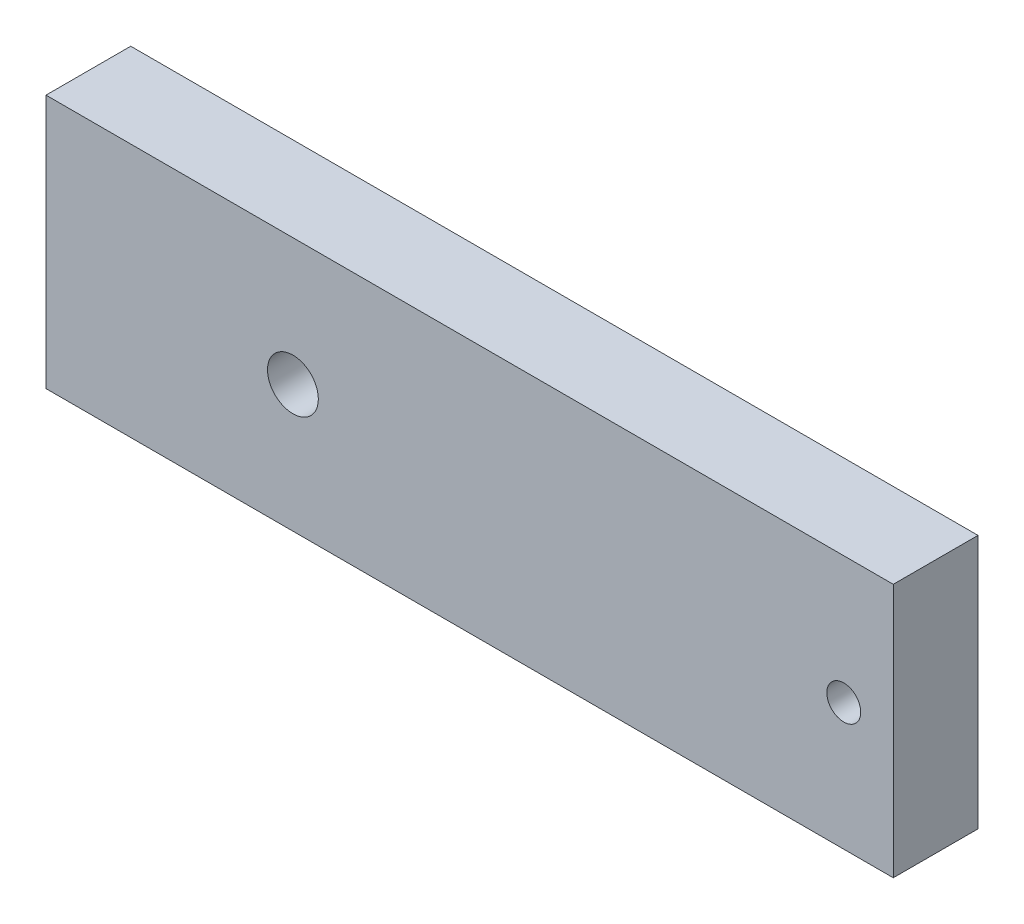
ISO-10303-21;
HEADER;
FILE_DESCRIPTION(('STEP AP214'),'2;1');
FILE_NAME('part.step','',(''),(''),'','','');
FILE_SCHEMA(('AUTOMOTIVE_DESIGN { 1 0 10303 214 1 1 1 1 }'));
ENDSEC;
DATA;
#1=APPLICATION_CONTEXT('core data for automotive mechanical design processes');
#2=APPLICATION_PROTOCOL_DEFINITION('international standard','automotive_design',2000,#1);
#3=PRODUCT_CONTEXT('',#1,'mechanical');
#4=PRODUCT('Part','Part','',(#3));
#5=PRODUCT_RELATED_PRODUCT_CATEGORY('part','',(#4));
#6=PRODUCT_DEFINITION_FORMATION('','',#4);
#7=PRODUCT_DEFINITION_CONTEXT('part definition',#1,'design');
#8=PRODUCT_DEFINITION('design','',#6,#7);
#9=PRODUCT_DEFINITION_SHAPE('','',#8);
#10=(LENGTH_UNIT() NAMED_UNIT(*) SI_UNIT(.MILLI.,.METRE.));
#11=(NAMED_UNIT(*) PLANE_ANGLE_UNIT() SI_UNIT($,.RADIAN.));
#12=(NAMED_UNIT(*) SI_UNIT($,.STERADIAN.) SOLID_ANGLE_UNIT());
#13=UNCERTAINTY_MEASURE_WITH_UNIT(LENGTH_MEASURE(1.E-05),#10,'distance_accuracy_value','');
#14=(GEOMETRIC_REPRESENTATION_CONTEXT(3) GLOBAL_UNCERTAINTY_ASSIGNED_CONTEXT((#13)) GLOBAL_UNIT_ASSIGNED_CONTEXT((#10,
#11,#12)) REPRESENTATION_CONTEXT('',''));
#15=CARTESIAN_POINT('',(0.,0.,0.));
#16=DIRECTION('',(0.,0.,1.));
#17=DIRECTION('',(1.,0.,0.));
#18=AXIS2_PLACEMENT_3D('',#15,#16,#17);
#19=CARTESIAN_POINT('',(25.,-7.5,5.));
#20=DIRECTION('',(-1.,0.,0.));
#21=DIRECTION('',(0.,0.,1.));
#22=AXIS2_PLACEMENT_3D('',#19,#20,#21);
#23=PLANE('',#22);
#24=DIRECTION('',(0.,1.,0.));
#25=VECTOR('',#24,1.);
#26=CARTESIAN_POINT('',(25.,-7.5,0.));
#27=LINE('',#26,#25);
#28=CARTESIAN_POINT('',(25.,-7.5,0.));
#29=VERTEX_POINT('',#28);
#30=CARTESIAN_POINT('',(25.,7.5,0.));
#31=VERTEX_POINT('',#30);
#32=EDGE_CURVE('E96',#29,#31,#27,.T.);
#33=ORIENTED_EDGE('',*,*,#32,.T.);
#34=DIRECTION('',(0.,0.,-1.));
#35=VECTOR('',#34,1.);
#36=CARTESIAN_POINT('',(25.,7.5,5.));
#37=LINE('',#36,#35);
#38=CARTESIAN_POINT('',(25.,7.5,5.));
#39=VERTEX_POINT('',#38);
#40=EDGE_CURVE('E11',#39,#31,#37,.T.);
#41=ORIENTED_EDGE('',*,*,#40,.F.);
#42=DIRECTION('',(0.,1.,0.));
#43=VECTOR('',#42,1.);
#44=CARTESIAN_POINT('',(25.,-7.5,5.));
#45=LINE('',#44,#43);
#46=CARTESIAN_POINT('',(25.,-7.5,5.));
#47=VERTEX_POINT('',#46);
#48=EDGE_CURVE('E84',#47,#39,#45,.T.);
#49=ORIENTED_EDGE('',*,*,#48,.F.);
#50=DIRECTION('',(0.,0.,-1.));
#51=VECTOR('',#50,1.);
#52=CARTESIAN_POINT('',(25.,-7.5,5.));
#53=LINE('',#52,#51);
#54=EDGE_CURVE('E92',#47,#29,#53,.T.);
#55=ORIENTED_EDGE('',*,*,#54,.T.);
#56=EDGE_LOOP('',(#33,#41,#49,#55));
#57=FACE_BOUND('',#56,.T.);
#58=ADVANCED_FACE('F33',(#57),#23,.F.);
#59=CARTESIAN_POINT('',(-25.,7.5,5.));
#60=DIRECTION('',(0.,-1.,0.));
#61=DIRECTION('',(0.,0.,-1.));
#62=AXIS2_PLACEMENT_3D('',#59,#60,#61);
#63=PLANE('',#62);
#64=DIRECTION('',(-1.,0.,0.));
#65=VECTOR('',#64,1.);
#66=CARTESIAN_POINT('',(-25.,7.5,0.));
#67=LINE('',#66,#65);
#68=CARTESIAN_POINT('',(-25.,7.5,0.));
#69=VERTEX_POINT('',#68);
#70=EDGE_CURVE('E88',#31,#69,#67,.T.);
#71=ORIENTED_EDGE('',*,*,#70,.T.);
#72=DIRECTION('',(0.,0.,-1.));
#73=VECTOR('',#72,1.);
#74=CARTESIAN_POINT('',(-25.,7.5,5.));
#75=LINE('',#74,#73);
#76=CARTESIAN_POINT('',(-25.,7.5,5.));
#77=VERTEX_POINT('',#76);
#78=EDGE_CURVE('E41',#77,#69,#75,.T.);
#79=ORIENTED_EDGE('',*,*,#78,.F.);
#80=DIRECTION('',(-1.,0.,0.));
#81=VECTOR('',#80,1.);
#82=CARTESIAN_POINT('',(-25.,7.5,5.));
#83=LINE('',#82,#81);
#84=EDGE_CURVE('E79',#39,#77,#83,.T.);
#85=ORIENTED_EDGE('',*,*,#84,.F.);
#86=ORIENTED_EDGE('',*,*,#40,.T.);
#87=EDGE_LOOP('',(#71,#79,#85,#86));
#88=FACE_BOUND('',#87,.T.);
#89=ADVANCED_FACE('F87',(#88),#63,.F.);
#90=CARTESIAN_POINT('',(-25.,-7.5,5.));
#91=DIRECTION('',(1.,0.,0.));
#92=DIRECTION('',(0.,0.,-1.));
#93=AXIS2_PLACEMENT_3D('',#90,#91,#92);
#94=PLANE('',#93);
#95=DIRECTION('',(0.,-1.,0.));
#96=VECTOR('',#95,1.);
#97=CARTESIAN_POINT('',(-25.,-7.5,0.));
#98=LINE('',#97,#96);
#99=CARTESIAN_POINT('',(-25.,-7.5,0.));
#100=VERTEX_POINT('',#99);
#101=EDGE_CURVE('E66',#69,#100,#98,.T.);
#102=ORIENTED_EDGE('',*,*,#101,.T.);
#103=DIRECTION('',(0.,0.,-1.));
#104=VECTOR('',#103,1.);
#105=CARTESIAN_POINT('',(-25.,-7.5,5.));
#106=LINE('',#105,#104);
#107=CARTESIAN_POINT('',(-25.,-7.5,5.));
#108=VERTEX_POINT('',#107);
#109=EDGE_CURVE('E89',#108,#100,#106,.T.);
#110=ORIENTED_EDGE('',*,*,#109,.F.);
#111=DIRECTION('',(0.,-1.,0.));
#112=VECTOR('',#111,1.);
#113=CARTESIAN_POINT('',(-25.,-7.5,5.));
#114=LINE('',#113,#112);
#115=EDGE_CURVE('E82',#77,#108,#114,.T.);
#116=ORIENTED_EDGE('',*,*,#115,.F.);
#117=ORIENTED_EDGE('',*,*,#78,.T.);
#118=EDGE_LOOP('',(#102,#110,#116,#117));
#119=FACE_BOUND('',#118,.T.);
#120=ADVANCED_FACE('F90',(#119),#94,.F.);
#121=CARTESIAN_POINT('',(-25.,-7.5,5.));
#122=DIRECTION('',(0.,1.,0.));
#123=DIRECTION('',(0.,0.,1.));
#124=AXIS2_PLACEMENT_3D('',#121,#122,#123);
#125=PLANE('',#124);
#126=DIRECTION('',(1.,0.,0.));
#127=VECTOR('',#126,1.);
#128=CARTESIAN_POINT('',(-25.,-7.5,0.));
#129=LINE('',#128,#127);
#130=EDGE_CURVE('E72',#100,#29,#129,.T.);
#131=ORIENTED_EDGE('',*,*,#130,.T.);
#132=ORIENTED_EDGE('',*,*,#54,.F.);
#133=DIRECTION('',(1.,0.,0.));
#134=VECTOR('',#133,1.);
#135=CARTESIAN_POINT('',(-25.,-7.5,5.));
#136=LINE('',#135,#134);
#137=EDGE_CURVE('E49',#108,#47,#136,.T.);
#138=ORIENTED_EDGE('',*,*,#137,.F.);
#139=ORIENTED_EDGE('',*,*,#109,.T.);
#140=EDGE_LOOP('',(#131,#132,#138,#139));
#141=FACE_BOUND('',#140,.T.);
#142=ADVANCED_FACE('F104',(#141),#125,.F.);
#143=CARTESIAN_POINT('',(0.,0.,5.));
#144=DIRECTION('',(0.,0.,-1.));
#145=DIRECTION('',(-1.,0.,0.));
#146=AXIS2_PLACEMENT_3D('',#143,#144,#145);
#147=PLANE('',#146);
#148=CARTESIAN_POINT('',(22.0789346408499,0.,5.));
#149=DIRECTION('',(0.,0.,1.));
#150=DIRECTION('',(1.,0.,0.));
#151=AXIS2_PLACEMENT_3D('',#148,#149,#150);
#152=CIRCLE('',#151,1.);
#153=CARTESIAN_POINT('',(23.0789346408499,0.,5.));
#154=VERTEX_POINT('',#153);
#155=EDGE_CURVE('E116',#154,#154,#152,.T.);
#156=ORIENTED_EDGE('',*,*,#155,.F.);
#157=EDGE_LOOP('',(#156));
#158=FACE_BOUND('',#157,.T.);
#159=CARTESIAN_POINT('',(-10.4291883393694,0.,5.));
#160=DIRECTION('',(0.,0.,1.));
#161=DIRECTION('',(1.,0.,0.));
#162=AXIS2_PLACEMENT_3D('',#159,#160,#161);
#163=CIRCLE('',#162,1.5);
#164=CARTESIAN_POINT('',(-8.92918833936943,0.,5.));
#165=VERTEX_POINT('',#164);
#166=EDGE_CURVE('E110',#165,#165,#163,.T.);
#167=ORIENTED_EDGE('',*,*,#166,.F.);
#168=EDGE_LOOP('',(#167));
#169=FACE_BOUND('',#168,.T.);
#170=ORIENTED_EDGE('',*,*,#48,.T.);
#171=ORIENTED_EDGE('',*,*,#84,.T.);
#172=ORIENTED_EDGE('',*,*,#115,.T.);
#173=ORIENTED_EDGE('',*,*,#137,.T.);
#174=EDGE_LOOP('',(#170,#171,#172,#173));
#175=FACE_BOUND('',#174,.T.);
#176=ADVANCED_FACE('F80',(#158,#169,#175),#147,.F.);
#177=CARTESIAN_POINT('',(0.,0.,0.));
#178=DIRECTION('',(0.,0.,-1.));
#179=DIRECTION('',(-1.,0.,0.));
#180=AXIS2_PLACEMENT_3D('',#177,#178,#179);
#181=PLANE('',#180);
#182=CARTESIAN_POINT('',(22.0789346408499,0.,0.));
#183=DIRECTION('',(0.,0.,1.));
#184=DIRECTION('',(1.,0.,0.));
#185=AXIS2_PLACEMENT_3D('',#182,#183,#184);
#186=CIRCLE('',#185,1.);
#187=CARTESIAN_POINT('',(23.0789346408499,0.,0.));
#188=VERTEX_POINT('',#187);
#189=EDGE_CURVE('E113',#188,#188,#186,.T.);
#190=ORIENTED_EDGE('',*,*,#189,.T.);
#191=EDGE_LOOP('',(#190));
#192=FACE_BOUND('',#191,.T.);
#193=CARTESIAN_POINT('',(-10.4291883393694,0.,0.));
#194=DIRECTION('',(0.,0.,1.));
#195=DIRECTION('',(1.,0.,0.));
#196=AXIS2_PLACEMENT_3D('',#193,#194,#195);
#197=CIRCLE('',#196,1.5);
#198=CARTESIAN_POINT('',(-8.92918833936943,0.,0.));
#199=VERTEX_POINT('',#198);
#200=EDGE_CURVE('E99',#199,#199,#197,.T.);
#201=ORIENTED_EDGE('',*,*,#200,.T.);
#202=EDGE_LOOP('',(#201));
#203=FACE_BOUND('',#202,.T.);
#204=ORIENTED_EDGE('',*,*,#32,.F.);
#205=ORIENTED_EDGE('',*,*,#130,.F.);
#206=ORIENTED_EDGE('',*,*,#101,.F.);
#207=ORIENTED_EDGE('',*,*,#70,.F.);
#208=EDGE_LOOP('',(#204,#205,#206,#207));
#209=FACE_BOUND('',#208,.T.);
#210=ADVANCED_FACE('F107',(#192,#203,#209),#181,.T.);
#211=CARTESIAN_POINT('',(-10.4291883393694,0.,0.));
#212=DIRECTION('',(0.,0.,1.));
#213=DIRECTION('',(1.,0.,0.));
#214=AXIS2_PLACEMENT_3D('',#211,#212,#213);
#215=CYLINDRICAL_SURFACE('',#214,1.5);
#216=ORIENTED_EDGE('',*,*,#200,.F.);
#217=EDGE_LOOP('',(#216));
#218=FACE_BOUND('',#217,.T.);
#219=ORIENTED_EDGE('',*,*,#166,.T.);
#220=EDGE_LOOP('',(#219));
#221=FACE_BOUND('',#220,.T.);
#222=ADVANCED_FACE('F127',(#218,#221),#215,.F.);
#223=CARTESIAN_POINT('',(22.0789346408499,0.,0.));
#224=DIRECTION('',(0.,0.,1.));
#225=DIRECTION('',(1.,0.,0.));
#226=AXIS2_PLACEMENT_3D('',#223,#224,#225);
#227=CYLINDRICAL_SURFACE('',#226,1.);
#228=ORIENTED_EDGE('',*,*,#189,.F.);
#229=EDGE_LOOP('',(#228));
#230=FACE_BOUND('',#229,.T.);
#231=ORIENTED_EDGE('',*,*,#155,.T.);
#232=EDGE_LOOP('',(#231));
#233=FACE_BOUND('',#232,.T.);
#234=ADVANCED_FACE('F124',(#230,#233),#227,.F.);
#235=CLOSED_SHELL('',(#58,#89,#120,#142,#176,#210,#222,#234));
#236=MANIFOLD_SOLID_BREP('B2',#235);
#237=ADVANCED_BREP_SHAPE_REPRESENTATION('',(#18,#236),#14);
#238=SHAPE_DEFINITION_REPRESENTATION(#9,#237);
ENDSEC;
END-ISO-10303-21;
